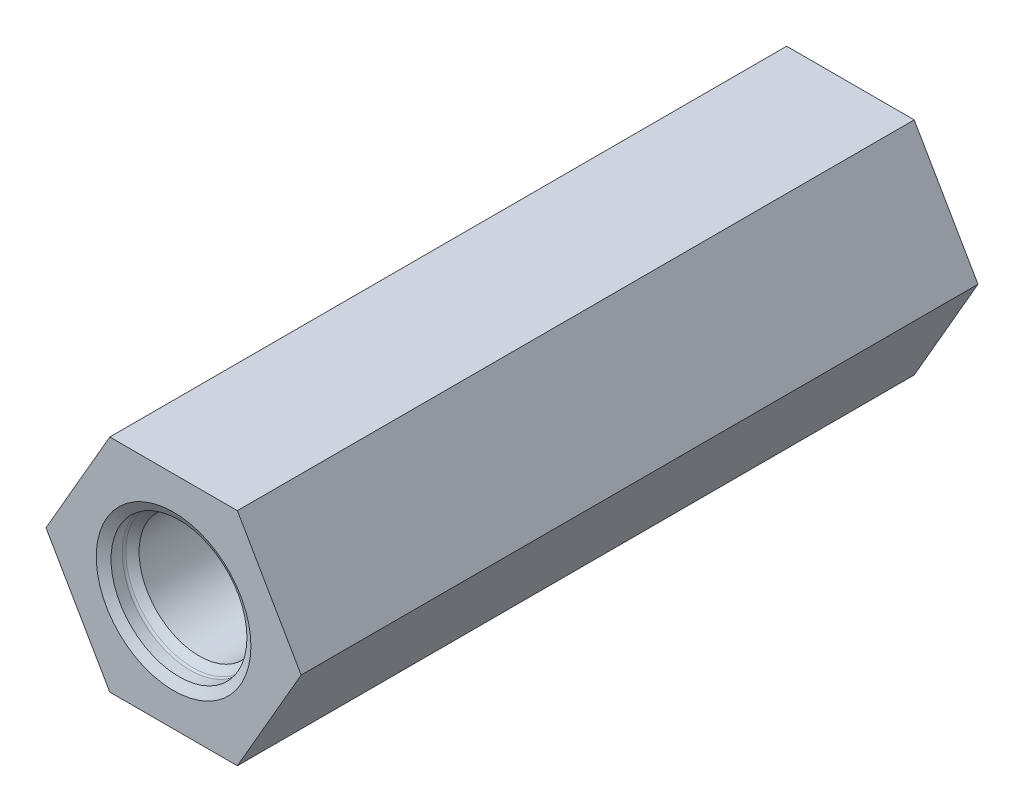
ISO-10303-21;
HEADER;
FILE_DESCRIPTION(('STEP AP214'),'2;1');
FILE_NAME('part.step','',(''),(''),'','','');
FILE_SCHEMA(('AUTOMOTIVE_DESIGN { 1 0 10303 214 1 1 1 1 }'));
ENDSEC;
DATA;
#1=APPLICATION_CONTEXT('core data for automotive mechanical design processes');
#2=APPLICATION_PROTOCOL_DEFINITION('international standard','automotive_design',2000,#1);
#3=PRODUCT_CONTEXT('',#1,'mechanical');
#4=PRODUCT('Part','Part','',(#3));
#5=PRODUCT_RELATED_PRODUCT_CATEGORY('part','',(#4));
#6=PRODUCT_DEFINITION_FORMATION('','',#4);
#7=PRODUCT_DEFINITION_CONTEXT('part definition',#1,'design');
#8=PRODUCT_DEFINITION('design','',#6,#7);
#9=PRODUCT_DEFINITION_SHAPE('','',#8);
#10=(LENGTH_UNIT() NAMED_UNIT(*) SI_UNIT(.MILLI.,.METRE.));
#11=(NAMED_UNIT(*) PLANE_ANGLE_UNIT() SI_UNIT($,.RADIAN.));
#12=(NAMED_UNIT(*) SI_UNIT($,.STERADIAN.) SOLID_ANGLE_UNIT());
#13=UNCERTAINTY_MEASURE_WITH_UNIT(LENGTH_MEASURE(1.E-05),#10,'distance_accuracy_value','');
#14=(GEOMETRIC_REPRESENTATION_CONTEXT(3) GLOBAL_UNCERTAINTY_ASSIGNED_CONTEXT((#13)) GLOBAL_UNIT_ASSIGNED_CONTEXT((#10,
#11,#12)) REPRESENTATION_CONTEXT('',''));
#15=CARTESIAN_POINT('',(0.,0.,0.));
#16=DIRECTION('',(0.,0.,1.));
#17=DIRECTION('',(1.,0.,0.));
#18=AXIS2_PLACEMENT_3D('',#15,#16,#17);
#19=CARTESIAN_POINT('',(0.,0.,26.162));
#20=DIRECTION('',(0.,0.,-1.));
#21=DIRECTION('',(-1.,0.,0.));
#22=AXIS2_PLACEMENT_3D('',#19,#20,#21);
#23=CYLINDRICAL_SURFACE('',#22,6.3754);
#24=CARTESIAN_POINT('',(-2.03314907367152,-6.04251851500917,21.59));
#25=CARTESIAN_POINT('',(-2.0331370575578,-6.0425188183239,21.4867851013207));
#26=CARTESIAN_POINT('',(-2.03794865062864,-6.04090894637527,21.3836129702349));
#27=CARTESIAN_POINT('',(-2.05697745294591,-6.03445775060883,21.1782088212646));
#28=CARTESIAN_POINT('',(-2.07119645824721,-6.02961580972568,21.0759769866802));
#29=CARTESIAN_POINT('',(-2.10855293049997,-6.01665314263859,20.8732486112649));
#30=CARTESIAN_POINT('',(-2.13170161069558,-6.00852829338303,20.7727544188834));
#31=CARTESIAN_POINT('',(-2.18613937401214,-5.98893601687927,20.5743097709583));
#32=CARTESIAN_POINT('',(-2.21743259463609,-5.97746689034937,20.4763606362242));
#33=CARTESIAN_POINT('',(-2.32148989194522,-5.93817084015464,20.189128083578));
#34=CARTESIAN_POINT('',(-2.40486464995926,-5.90532106123124,20.0042895234161));
#35=CARTESIAN_POINT('',(-2.59283520788646,-5.82523292218468,19.6494002160034));
#36=CARTESIAN_POINT('',(-2.69743561543405,-5.77799143681188,19.4793526910399));
#37=CARTESIAN_POINT('',(-2.93890865683772,-5.65944214459436,19.1302732554517));
#38=CARTESIAN_POINT('',(-3.07827027653292,-5.58556050798338,18.9538364641958));
#39=CARTESIAN_POINT('',(-3.36962164233222,-5.41478450585516,18.6235800032059));
#40=CARTESIAN_POINT('',(-3.52162332633979,-5.31786822104639,18.4697821032894));
#41=CARTESIAN_POINT('',(-3.76485355299338,-5.14619852726385,18.2482806792272));
#42=CARTESIAN_POINT('',(-3.85420158895494,-5.07975423103156,18.1719330691308));
#43=CARTESIAN_POINT('',(-4.03353883974174,-4.93855159314286,18.028235444797));
#44=CARTESIAN_POINT('',(-4.12352776448058,-4.86379681384201,17.9608816023536));
#45=CARTESIAN_POINT('',(-4.3028415655266,-4.70590540492443,17.835947471298));
#46=CARTESIAN_POINT('',(-4.39216678305047,-4.62277345609321,17.7783617724278));
#47=CARTESIAN_POINT('',(-4.56887189886833,-4.44820699733545,17.6737488215455));
#48=CARTESIAN_POINT('',(-4.65625220188703,-4.35677423525493,17.6267193539879));
#49=CARTESIAN_POINT('',(-4.81820248358557,-4.17656095263081,17.548614816817));
#50=CARTESIAN_POINT('',(-4.89311964888449,-4.08860760093343,17.516349819812));
#51=CARTESIAN_POINT('',(-5.0393623398526,-3.90693504399104,17.4613363485931));
#52=CARTESIAN_POINT('',(-5.11068855214855,-3.81321694869641,17.4385860489466));
#53=CARTESIAN_POINT('',(-5.24876710650366,-3.62079805999627,17.4030237211067));
#54=CARTESIAN_POINT('',(-5.31552378819448,-3.52210215316743,17.3902021409127));
#55=CARTESIAN_POINT('',(-5.44370753711686,-3.32054659788616,17.374711352774));
#56=CARTESIAN_POINT('',(-5.50513533601186,-3.2176875238959,17.3720407489226));
#57=CARTESIAN_POINT('',(-5.61321463273305,-3.02454876051913,17.376532701524));
#58=CARTESIAN_POINT('',(-5.66070006487378,-2.9346984191047,17.3822794211601));
#59=CARTESIAN_POINT('',(-5.75105820724428,-2.75341847306455,17.4010552780294));
#60=CARTESIAN_POINT('',(-5.79392955899573,-2.66198841248278,17.4140865530259));
#61=CARTESIAN_POINT('',(-5.87483749803305,-2.47832052904433,17.4472518360044));
#62=CARTESIAN_POINT('',(-5.91287572200012,-2.38608299100102,17.4673834307809));
#63=CARTESIAN_POINT('',(-5.98407234835712,-2.20145744669158,17.5144870248974));
#64=CARTESIAN_POINT('',(-6.01722885122136,-2.10906939592271,17.5414616758794));
#65=CARTESIAN_POINT('',(-6.10916583181434,-1.83334478154829,17.6319889321352));
#66=CARTESIAN_POINT('',(-6.16074362427262,-1.65068821011808,17.7052848065934));
#67=CARTESIAN_POINT('',(-6.24578958879975,-1.29224133720656,17.8749845319125));
#68=CARTESIAN_POINT('',(-6.27925436169099,-1.11645233026496,17.9713927152472));
#69=CARTESIAN_POINT('',(-6.33376941273993,-0.75304804942321,18.1985925154279));
#70=CARTESIAN_POINT('',(-6.3526271581918,-0.566887250358405,18.3322304153752));
#71=CARTESIAN_POINT('',(-6.37434589974819,-0.212251733006239,18.6227844418999));
#72=CARTESIAN_POINT('',(-6.37718203403838,-0.043804899906035,18.779736359348));
#73=CARTESIAN_POINT('',(-6.37278610287283,0.203830751083498,19.0436022199468));
#74=CARTESIAN_POINT('',(-6.36930906167396,0.290610352535047,19.1435596339514));
#75=CARTESIAN_POINT('',(-6.35963371278686,0.455658023740201,19.3501435899834));
#76=CARTESIAN_POINT('',(-6.35343480603832,0.533924215027797,19.4567715957207));
#77=CARTESIAN_POINT('',(-6.33236532480172,0.753980370263467,19.7859793390797));
#78=CARTESIAN_POINT('',(-6.31500187550329,0.881532247205133,20.018409693044));
#79=CARTESIAN_POINT('',(-6.28754598946052,1.05740510154389,20.435811024595));
#80=CARTESIAN_POINT('',(-6.27678550948411,1.11793023193376,20.615629778819));
#81=CARTESIAN_POINT('',(-6.259973432144,1.20856406652653,20.9829146542108));
#82=CARTESIAN_POINT('',(-6.25391389795248,1.23872406336782,21.1703673208764));
#83=CARTESIAN_POINT('',(-6.24849630998751,1.26579983291013,21.5485720582015));
#84=CARTESIAN_POINT('',(-6.24916535842303,1.26258115728527,21.7393343802194));
#85=CARTESIAN_POINT('',(-6.25704039544116,1.22292044357705,22.1172967237932));
#86=CARTESIAN_POINT('',(-6.26425175359991,1.18645111502268,22.3044936902217));
#87=CARTESIAN_POINT('',(-6.28240290565684,1.08607371304753,22.6620233800491));
#88=CARTESIAN_POINT('',(-6.29316359907238,1.02345119161935,22.8327358026317));
#89=CARTESIAN_POINT('',(-6.31549011687413,0.875167280235777,23.1636826187533));
#90=CARTESIAN_POINT('',(-6.32705620780751,0.789498235892869,23.3239135090659));
#91=CARTESIAN_POINT('',(-6.35000793070989,0.579916787941198,23.6633823650095));
#92=CARTESIAN_POINT('',(-6.36089814014887,0.451785259710807,23.8400435580918));
#93=CARTESIAN_POINT('',(-6.37458212961861,0.173069163443851,24.1751910748327));
#94=CARTESIAN_POINT('',(-6.37736598407114,0.022457306940102,24.3336548895382));
#95=CARTESIAN_POINT('',(-6.36975078628892,-0.330728900445925,24.662146850907));
#96=CARTESIAN_POINT('',(-6.35645144879133,-0.537566165823935,24.8275803003689));
#97=CARTESIAN_POINT('',(-6.30478693970404,-0.971056791560973,25.1251887580276));
#98=CARTESIAN_POINT('',(-6.26644527134361,-1.19769139872381,25.2573947905287));
#99=CARTESIAN_POINT('',(-6.16971904853107,-1.61778386353928,25.4610169395708));
#100=CARTESIAN_POINT('',(-6.11667837289289,-1.80912871774754,25.539253982408));
#101=CARTESIAN_POINT('',(-6.02123006178371,-2.09781867839265,25.6352022289412));
#102=CARTESIAN_POINT('',(-5.98675993021702,-2.1943415491342,25.663619656697));
#103=CARTESIAN_POINT('',(-5.91248820288261,-2.38722963598347,25.7129844526176));
#104=CARTESIAN_POINT('',(-5.87268875152761,-2.48359489980399,25.7339348130307));
#105=CARTESIAN_POINT('',(-5.78763764821154,-2.67583231360076,25.7681537970706));
#106=CARTESIAN_POINT('',(-5.74236138164202,-2.77170005340558,25.7813860578082));
#107=CARTESIAN_POINT('',(-5.64675103781995,-2.96162524180933,25.7998140453012));
#108=CARTESIAN_POINT('',(-5.59641904096843,-3.05568341620221,25.8050130633741));
#109=CARTESIAN_POINT('',(-5.49103531806099,-3.24124095026326,25.8073020473605));
#110=CARTESIAN_POINT('',(-5.435982760772,-3.33273985549795,25.8043905822631));
#111=CARTESIAN_POINT('',(-5.32165226771686,-3.51241823133756,25.7905025060141));
#112=CARTESIAN_POINT('',(-5.262374504544,-3.60059783730626,25.7795262241277));
#113=CARTESIAN_POINT('',(-5.14437183096311,-3.76707372525184,25.7507030015666));
#114=CARTESIAN_POINT('',(-5.08588876941042,-3.84563279436523,25.7333799428956));
#115=CARTESIAN_POINT('',(-4.96627405285197,-3.99891456332899,25.6921081661993));
#116=CARTESIAN_POINT('',(-4.90514150570314,-4.07363595214489,25.6681572015546));
#117=CARTESIAN_POINT('',(-4.71862421114552,-4.29147327510678,25.5867712057312));
#118=CARTESIAN_POINT('',(-4.59002222542035,-4.42839872973822,25.5197788448186));
#119=CARTESIAN_POINT('',(-4.32083311828951,-4.69189159141658,25.3581551448359));
#120=CARTESIAN_POINT('',(-4.17999642101902,-4.81729631312714,25.2620718558443));
#121=CARTESIAN_POINT('',(-3.8987954642153,-5.0475920467497,25.0472667688591));
#122=CARTESIAN_POINT('',(-3.75843156351975,-5.15246991683649,24.9285305633034));
#123=CARTESIAN_POINT('',(-3.46130973188953,-5.35747393807893,24.6507622547977));
#124=CARTESIAN_POINT('',(-3.30543453989242,-5.45427333059767,24.4883307778605));
#125=CARTESIAN_POINT('',(-3.00808524491948,-5.62373951342624,24.139247448442));
#126=CARTESIAN_POINT('',(-2.86662082885426,-5.6963901442351,23.9525794934565));
#127=CARTESIAN_POINT('',(-2.61882458643902,-5.81416845905753,23.5750197456534));
#128=CARTESIAN_POINT('',(-2.51046701562281,-5.86119933327316,23.3860587122575));
#129=CARTESIAN_POINT('',(-2.32144248791677,-5.93861214475131,22.9916893264351));
#130=CARTESIAN_POINT('',(-2.24071754412174,-5.96902902733269,22.7863165458026));
#131=CARTESIAN_POINT('',(-2.13142064531282,-6.00876605233198,22.4155492595577));
#132=CARTESIAN_POINT('',(-2.09488152560429,-6.02144649901733,22.2528618523694));
#133=CARTESIAN_POINT('',(-2.04576253477223,-6.03831997228084,21.9234108176512));
#134=CARTESIAN_POINT('',(-2.03316847475929,-6.04251802528048,21.7566496634407));
#135=CARTESIAN_POINT('',(-2.03314907367152,-6.04251851500917,21.59));
#136=B_SPLINE_CURVE_WITH_KNOTS('',3,(#24,#25,#26,#27,#28,#29,#30,#31,#32,#33,#34,#35,#36,#37,
#38,#39,#40,#41,#42,#43,#44,#45,#46,#47,#48,#49,#50,#51,#52,#53,#54,#55,#56,#57,#58,#59,#60,#61,
#62,#63,#64,#65,#66,#67,#68,#69,#70,#71,#72,#73,#74,#75,#76,#77,#78,#79,#80,#81,#82,#83,#84,#85,
#86,#87,#88,#89,#90,#91,#92,#93,#94,#95,#96,#97,#98,#99,#100,#101,#102,#103,#104,#105,#106,#107,
#108,#109,#110,#111,#112,#113,#114,#115,#116,#117,#118,#119,#120,#121,#122,#123,#124,#125,#126,
#127,#128,#129,#130,#131,#132,#133,#134,#135),.UNSPECIFIED.,.T.,.F.,(4,2,2,2,2,2,2,2,2,2,2,2,2,
2,2,2,2,2,2,2,2,2,2,2,2,2,2,2,2,2,2,2,2,2,2,2,2,2,2,2,2,2,2,2,2,2,2,2,2,2,2,2,2,2,2,4),(0.,
0.309448303531951,0.618955703717077,0.92885303293183,1.23890810123504,1.85245353228132,
2.46613229366875,3.17354819729196,3.88163997747334,4.28618785897242,4.69056299159343,
5.09471341740329,5.49877894049994,5.85810728746754,6.21736666419853,6.57627998180749,
6.93514394183593,7.24014050676989,7.545226624602,7.85020915172852,8.15531003869406,
8.7630219767322,9.37084792145026,10.0580677852884,10.7463537622063,11.1431678007208,
11.5400692185663,12.3317099777673,12.8996168930445,13.4665628849987,14.0357934031087,
14.6054915381071,15.1499809336188,15.6946513928562,16.3478799338502,17.0019079649136,
17.7936968328853,18.5847436411214,19.2220435897256,19.5407859263628,19.8594003906569,
20.1795040898534,20.4994766038505,20.8195055772634,21.1395214854582,21.4375498908815,
21.7356794411181,22.3314361569511,22.9640020513948,23.5969716156851,24.3292435401714,
25.0620044933801,25.7280728278758,26.3927347278066,26.8926629549138,27.3922948520115),.UNSPECIFIED.);
#137=CARTESIAN_POINT('',(-2.03314907367152,-6.04251851500917,21.59));
#138=VERTEX_POINT('',#137);
#139=EDGE_CURVE('E143',#138,#138,#136,.T.);
#140=ORIENTED_EDGE('',*,*,#139,.F.);
#141=EDGE_LOOP('',(#140));
#142=FACE_BOUND('',#141,.T.);
#143=CARTESIAN_POINT('',(0.,0.,3.30922048968553));
#144=DIRECTION('',(0.,0.,1.));
#145=DIRECTION('',(1.,0.,0.));
#146=AXIS2_PLACEMENT_3D('',#143,#144,#145);
#147=CIRCLE('',#146,6.3754);
#148=CARTESIAN_POINT('',(6.3754,0.,3.30922048968553));
#149=VERTEX_POINT('',#148);
#150=EDGE_CURVE('E226',#149,#149,#147,.T.);
#151=ORIENTED_EDGE('',*,*,#150,.F.);
#152=EDGE_LOOP('',(#151));
#153=FACE_BOUND('',#152,.T.);
#154=CARTESIAN_POINT('',(0.,0.,26.162));
#155=DIRECTION('',(0.,0.,-1.));
#156=DIRECTION('',(-1.,0.,0.));
#157=AXIS2_PLACEMENT_3D('',#154,#155,#156);
#158=CIRCLE('',#157,6.3754);
#159=CARTESIAN_POINT('',(-6.3754,0.,26.162));
#160=VERTEX_POINT('',#159);
#161=EDGE_CURVE('E151',#160,#160,#158,.T.);
#162=ORIENTED_EDGE('',*,*,#161,.F.);
#163=EDGE_LOOP('',(#162));
#164=FACE_BOUND('',#163,.T.);
#165=ADVANCED_FACE('F39',(#142,#153,#164),#23,.F.);
#166=CARTESIAN_POINT('',(0.,0.,33.759775));
#167=DIRECTION('',(0.,0.,1.));
#168=DIRECTION('',(1.,0.,0.));
#169=AXIS2_PLACEMENT_3D('',#166,#167,#168);
#170=CYLINDRICAL_SURFACE('',#169,7.14375);
#171=CARTESIAN_POINT('',(0.,0.,33.759775));
#172=DIRECTION('',(0.,0.,1.));
#173=DIRECTION('',(1.,0.,0.));
#174=AXIS2_PLACEMENT_3D('',#171,#172,#173);
#175=CIRCLE('',#174,7.14375);
#176=CARTESIAN_POINT('',(7.14375,0.,33.759775));
#177=VERTEX_POINT('',#176);
#178=EDGE_CURVE('E250',#177,#177,#175,.T.);
#179=ORIENTED_EDGE('',*,*,#178,.F.);
#180=EDGE_LOOP('',(#179));
#181=FACE_BOUND('',#180,.T.);
#182=CARTESIAN_POINT('',(0.,0.,76.922071969697));
#183=DIRECTION('',(0.,0.,1.));
#184=DIRECTION('',(1.,0.,0.));
#185=AXIS2_PLACEMENT_3D('',#182,#183,#184);
#186=CIRCLE('',#185,7.14375);
#187=CARTESIAN_POINT('',(7.14375,0.,76.922071969697));
#188=VERTEX_POINT('',#187);
#189=EDGE_CURVE('E43',#188,#188,#186,.F.);
#190=ORIENTED_EDGE('',*,*,#189,.F.);
#191=EDGE_LOOP('',(#190));
#192=FACE_BOUND('',#191,.T.);
#193=ADVANCED_FACE('F158',(#181,#192),#170,.F.);
#194=CARTESIAN_POINT('',(0.,0.,0.));
#195=DIRECTION('',(0.,0.,1.));
#196=DIRECTION('',(1.,0.,0.));
#197=AXIS2_PLACEMENT_3D('',#194,#195,#196);
#198=CYLINDRICAL_SURFACE('',#197,5.35813);
#199=CARTESIAN_POINT('',(0.,0.,26.162));
#200=DIRECTION('',(0.,0.,-1.));
#201=DIRECTION('',(-1.,0.,0.));
#202=AXIS2_PLACEMENT_3D('',#199,#200,#201);
#203=CIRCLE('',#202,5.35813);
#204=CARTESIAN_POINT('',(-5.35813,0.,26.162));
#205=VERTEX_POINT('',#204);
#206=EDGE_CURVE('E150',#205,#205,#203,.F.);
#207=ORIENTED_EDGE('',*,*,#206,.F.);
#208=EDGE_LOOP('',(#207));
#209=FACE_BOUND('',#208,.T.);
#210=CARTESIAN_POINT('',(0.,0.,33.759775));
#211=DIRECTION('',(0.,0.,1.));
#212=DIRECTION('',(1.,0.,0.));
#213=AXIS2_PLACEMENT_3D('',#210,#211,#212);
#214=CIRCLE('',#213,5.35813);
#215=CARTESIAN_POINT('',(5.35813,0.,33.759775));
#216=VERTEX_POINT('',#215);
#217=EDGE_CURVE('E253',#216,#216,#214,.F.);
#218=ORIENTED_EDGE('',*,*,#217,.F.);
#219=EDGE_LOOP('',(#218));
#220=FACE_BOUND('',#219,.T.);
#221=ADVANCED_FACE('F167',(#209,#220),#198,.F.);
#222=CARTESIAN_POINT('',(-9.16543552338532,15.875,97.259775));
#223=DIRECTION('',(0.866025403784439,-0.499999999999999,0.));
#224=DIRECTION('',(0.499999999999999,0.866025403784439,0.));
#225=AXIS2_PLACEMENT_3D('',#222,#223,#224);
#226=PLANE('',#225);
#227=DIRECTION('',(-0.499999999999999,-0.866025403784439,0.));
#228=VECTOR('',#227,1.);
#229=CARTESIAN_POINT('',(-9.16543552338532,15.875,0.));
#230=LINE('',#229,#228);
#231=CARTESIAN_POINT('',(-9.16543552338532,15.875,0.));
#232=VERTEX_POINT('',#231);
#233=CARTESIAN_POINT('',(-18.3308710467706,0.,0.));
#234=VERTEX_POINT('',#233);
#235=EDGE_CURVE('E126',#232,#234,#230,.T.);
#236=ORIENTED_EDGE('',*,*,#235,.T.);
#237=DIRECTION('',(0.,0.,-1.));
#238=VECTOR('',#237,1.);
#239=CARTESIAN_POINT('',(-18.3308710467706,0.,97.259775));
#240=LINE('',#239,#238);
#241=CARTESIAN_POINT('',(-18.3308710467706,0.,97.259775));
#242=VERTEX_POINT('',#241);
#243=EDGE_CURVE('E11',#242,#234,#240,.T.);
#244=ORIENTED_EDGE('',*,*,#243,.F.);
#245=DIRECTION('',(-0.499999999999999,-0.866025403784439,0.));
#246=VECTOR('',#245,1.);
#247=CARTESIAN_POINT('',(-9.16543552338532,15.875,97.259775));
#248=LINE('',#247,#246);
#249=CARTESIAN_POINT('',(-9.16543552338532,15.875,97.259775));
#250=VERTEX_POINT('',#249);
#251=EDGE_CURVE('E137',#250,#242,#248,.T.);
#252=ORIENTED_EDGE('',*,*,#251,.F.);
#253=DIRECTION('',(0.,0.,-1.));
#254=VECTOR('',#253,1.);
#255=CARTESIAN_POINT('',(-9.16543552338532,15.875,97.259775));
#256=LINE('',#255,#254);
#257=EDGE_CURVE('E122',#250,#232,#256,.T.);
#258=ORIENTED_EDGE('',*,*,#257,.T.);
#259=EDGE_LOOP('',(#236,#244,#252,#258));
#260=FACE_BOUND('',#259,.T.);
#261=ADVANCED_FACE('F41',(#260),#226,.F.);
#262=CARTESIAN_POINT('',(-18.3308710467706,0.,97.259775));
#263=DIRECTION('',(0.866025403784439,0.5,0.));
#264=DIRECTION('',(-0.5,0.866025403784439,0.));
#265=AXIS2_PLACEMENT_3D('',#262,#263,#264);
#266=PLANE('',#265);
#267=CARTESIAN_POINT('',(-13.748153285078,-7.93750000000001,21.59));
#268=DIRECTION('',(-0.866025403784439,-0.5,0.));
#269=DIRECTION('',(0.5,-0.866025403784439,0.));
#270=AXIS2_PLACEMENT_3D('',#267,#268,#269);
#271=CIRCLE('',#270,4.2164);
#272=CARTESIAN_POINT('',(-11.639953285078,-11.5890095125167,21.59));
#273=VERTEX_POINT('',#272);
#274=EDGE_CURVE('E130',#273,#273,#271,.T.);
#275=ORIENTED_EDGE('',*,*,#274,.F.);
#276=EDGE_LOOP('',(#275));
#277=FACE_BOUND('',#276,.T.);
#278=DIRECTION('',(0.5,-0.866025403784439,0.));
#279=VECTOR('',#278,1.);
#280=CARTESIAN_POINT('',(-18.3308710467706,0.,0.));
#281=LINE('',#280,#279);
#282=CARTESIAN_POINT('',(-9.16543552338532,-15.875,0.));
#283=VERTEX_POINT('',#282);
#284=EDGE_CURVE('E129',#234,#283,#281,.T.);
#285=ORIENTED_EDGE('',*,*,#284,.T.);
#286=DIRECTION('',(0.,0.,-1.));
#287=VECTOR('',#286,1.);
#288=CARTESIAN_POINT('',(-9.16543552338532,-15.875,97.259775));
#289=LINE('',#288,#287);
#290=CARTESIAN_POINT('',(-9.16543552338532,-15.875,97.259775));
#291=VERTEX_POINT('',#290);
#292=EDGE_CURVE('E49',#291,#283,#289,.T.);
#293=ORIENTED_EDGE('',*,*,#292,.F.);
#294=DIRECTION('',(0.5,-0.866025403784439,0.));
#295=VECTOR('',#294,1.);
#296=CARTESIAN_POINT('',(-18.3308710467706,0.,97.259775));
#297=LINE('',#296,#295);
#298=EDGE_CURVE('E95',#242,#291,#297,.T.);
#299=ORIENTED_EDGE('',*,*,#298,.F.);
#300=ORIENTED_EDGE('',*,*,#243,.T.);
#301=EDGE_LOOP('',(#285,#293,#299,#300));
#302=FACE_BOUND('',#301,.T.);
#303=ADVANCED_FACE('F261',(#277,#302),#266,.F.);
#304=CARTESIAN_POINT('',(-9.16543552338532,-15.875,97.259775));
#305=DIRECTION('',(0.,1.,0.));
#306=DIRECTION('',(-1.,0.,0.));
#307=AXIS2_PLACEMENT_3D('',#304,#305,#306);
#308=PLANE('',#307);
#309=DIRECTION('',(1.,0.,0.));
#310=VECTOR('',#309,1.);
#311=CARTESIAN_POINT('',(-9.16543552338532,-15.875,0.));
#312=LINE('',#311,#310);
#313=CARTESIAN_POINT('',(9.1654355233853,-15.875,0.));
#314=VERTEX_POINT('',#313);
#315=EDGE_CURVE('E132',#283,#314,#312,.T.);
#316=ORIENTED_EDGE('',*,*,#315,.T.);
#317=DIRECTION('',(0.,0.,-1.));
#318=VECTOR('',#317,1.);
#319=CARTESIAN_POINT('',(9.1654355233853,-15.875,97.259775));
#320=LINE('',#319,#318);
#321=CARTESIAN_POINT('',(9.1654355233853,-15.875,97.259775));
#322=VERTEX_POINT('',#321);
#323=EDGE_CURVE('E117',#322,#314,#320,.T.);
#324=ORIENTED_EDGE('',*,*,#323,.F.);
#325=DIRECTION('',(1.,0.,0.));
#326=VECTOR('',#325,1.);
#327=CARTESIAN_POINT('',(-9.16543552338532,-15.875,97.259775));
#328=LINE('',#327,#326);
#329=EDGE_CURVE('E108',#291,#322,#328,.T.);
#330=ORIENTED_EDGE('',*,*,#329,.F.);
#331=ORIENTED_EDGE('',*,*,#292,.T.);
#332=EDGE_LOOP('',(#316,#324,#330,#331));
#333=FACE_BOUND('',#332,.T.);
#334=ADVANCED_FACE('F264',(#333),#308,.F.);
#335=CARTESIAN_POINT('',(9.1654355233853,-15.875,97.259775));
#336=DIRECTION('',(-0.866025403784439,0.5,0.));
#337=DIRECTION('',(-0.5,-0.866025403784439,0.));
#338=AXIS2_PLACEMENT_3D('',#335,#336,#337);
#339=PLANE('',#338);
#340=DIRECTION('',(0.5,0.866025403784439,0.));
#341=VECTOR('',#340,1.);
#342=CARTESIAN_POINT('',(9.1654355233853,-15.875,0.));
#343=LINE('',#342,#341);
#344=CARTESIAN_POINT('',(18.3308710467706,0.,0.));
#345=VERTEX_POINT('',#344);
#346=EDGE_CURVE('E116',#314,#345,#343,.T.);
#347=ORIENTED_EDGE('',*,*,#346,.T.);
#348=DIRECTION('',(0.,0.,-1.));
#349=VECTOR('',#348,1.);
#350=CARTESIAN_POINT('',(18.3308710467706,0.,97.259775));
#351=LINE('',#350,#349);
#352=CARTESIAN_POINT('',(18.3308710467706,0.,97.259775));
#353=VERTEX_POINT('',#352);
#354=EDGE_CURVE('E113',#353,#345,#351,.T.);
#355=ORIENTED_EDGE('',*,*,#354,.F.);
#356=DIRECTION('',(0.5,0.866025403784439,0.));
#357=VECTOR('',#356,1.);
#358=CARTESIAN_POINT('',(9.1654355233853,-15.875,97.259775));
#359=LINE('',#358,#357);
#360=EDGE_CURVE('E102',#322,#353,#359,.T.);
#361=ORIENTED_EDGE('',*,*,#360,.F.);
#362=ORIENTED_EDGE('',*,*,#323,.T.);
#363=EDGE_LOOP('',(#347,#355,#361,#362));
#364=FACE_BOUND('',#363,.T.);
#365=ADVANCED_FACE('F114',(#364),#339,.F.);
#366=CARTESIAN_POINT('',(18.3308710467706,0.,97.259775));
#367=DIRECTION('',(-0.866025403784439,-0.5,0.));
#368=DIRECTION('',(0.5,-0.866025403784439,0.));
#369=AXIS2_PLACEMENT_3D('',#366,#367,#368);
#370=PLANE('',#369);
#371=DIRECTION('',(-0.5,0.866025403784439,0.));
#372=VECTOR('',#371,1.);
#373=CARTESIAN_POINT('',(18.3308710467706,0.,0.));
#374=LINE('',#373,#372);
#375=CARTESIAN_POINT('',(9.16543552338531,15.875,0.));
#376=VERTEX_POINT('',#375);
#377=EDGE_CURVE('E81',#345,#376,#374,.T.);
#378=ORIENTED_EDGE('',*,*,#377,.T.);
#379=DIRECTION('',(0.,0.,-1.));
#380=VECTOR('',#379,1.);
#381=CARTESIAN_POINT('',(9.16543552338531,15.875,97.259775));
#382=LINE('',#381,#380);
#383=CARTESIAN_POINT('',(9.16543552338531,15.875,97.259775));
#384=VERTEX_POINT('',#383);
#385=EDGE_CURVE('E118',#384,#376,#382,.T.);
#386=ORIENTED_EDGE('',*,*,#385,.F.);
#387=DIRECTION('',(-0.5,0.866025403784439,0.));
#388=VECTOR('',#387,1.);
#389=CARTESIAN_POINT('',(18.3308710467706,0.,97.259775));
#390=LINE('',#389,#388);
#391=EDGE_CURVE('E106',#353,#384,#390,.T.);
#392=ORIENTED_EDGE('',*,*,#391,.F.);
#393=ORIENTED_EDGE('',*,*,#354,.T.);
#394=EDGE_LOOP('',(#378,#386,#392,#393));
#395=FACE_BOUND('',#394,.T.);
#396=ADVANCED_FACE('F120',(#395),#370,.F.);
#397=CARTESIAN_POINT('',(9.16543552338531,15.875,97.259775));
#398=DIRECTION('',(0.,-1.,0.));
#399=DIRECTION('',(0.,0.,-1.));
#400=AXIS2_PLACEMENT_3D('',#397,#398,#399);
#401=PLANE('',#400);
#402=DIRECTION('',(-1.,0.,0.));
#403=VECTOR('',#402,1.);
#404=CARTESIAN_POINT('',(9.16543552338531,15.875,0.));
#405=LINE('',#404,#403);
#406=EDGE_CURVE('E87',#376,#232,#405,.T.);
#407=ORIENTED_EDGE('',*,*,#406,.T.);
#408=ORIENTED_EDGE('',*,*,#257,.F.);
#409=DIRECTION('',(-1.,0.,0.));
#410=VECTOR('',#409,1.);
#411=CARTESIAN_POINT('',(9.16543552338531,15.875,97.259775));
#412=LINE('',#411,#410);
#413=EDGE_CURVE('E58',#384,#250,#412,.T.);
#414=ORIENTED_EDGE('',*,*,#413,.F.);
#415=ORIENTED_EDGE('',*,*,#385,.T.);
#416=EDGE_LOOP('',(#407,#408,#414,#415));
#417=FACE_BOUND('',#416,.T.);
#418=ADVANCED_FACE('F269',(#417),#401,.F.);
#419=CARTESIAN_POINT('',(-27.4963065701559,-15.875,97.259775));
#420=DIRECTION('',(0.,0.,1.));
#421=DIRECTION('',(1.,0.,0.));
#422=AXIS2_PLACEMENT_3D('',#419,#420,#421);
#423=PLANE('',#422);
#424=CARTESIAN_POINT('',(0.,0.,97.259775));
#425=DIRECTION('',(0.,0.,1.));
#426=DIRECTION('',(1.,0.,0.));
#427=AXIS2_PLACEMENT_3D('',#424,#425,#426);
#428=CIRCLE('',#427,11.1125);
#429=CARTESIAN_POINT('',(11.1125,0.,97.259775));
#430=VERTEX_POINT('',#429);
#431=EDGE_CURVE('E232',#430,#430,#428,.T.);
#432=ORIENTED_EDGE('',*,*,#431,.F.);
#433=EDGE_LOOP('',(#432));
#434=FACE_BOUND('',#433,.T.);
#435=ORIENTED_EDGE('',*,*,#251,.T.);
#436=ORIENTED_EDGE('',*,*,#298,.T.);
#437=ORIENTED_EDGE('',*,*,#329,.T.);
#438=ORIENTED_EDGE('',*,*,#360,.T.);
#439=ORIENTED_EDGE('',*,*,#391,.T.);
#440=ORIENTED_EDGE('',*,*,#413,.T.);
#441=EDGE_LOOP('',(#435,#436,#437,#438,#439,#440));
#442=FACE_BOUND('',#441,.T.);
#443=ADVANCED_FACE('F104',(#434,#442),#423,.T.);
#444=CARTESIAN_POINT('',(-27.4963065701559,-15.875,0.));
#445=DIRECTION('',(0.,0.,1.));
#446=DIRECTION('',(1.,0.,0.));
#447=AXIS2_PLACEMENT_3D('',#444,#445,#446);
#448=PLANE('',#447);
#449=CARTESIAN_POINT('',(0.,0.,0.));
#450=DIRECTION('',(0.,0.,1.));
#451=DIRECTION('',(1.,0.,0.));
#452=AXIS2_PLACEMENT_3D('',#449,#450,#451);
#453=CIRCLE('',#452,8.7376);
#454=CARTESIAN_POINT('',(8.7376,0.,0.));
#455=VERTEX_POINT('',#454);
#456=EDGE_CURVE('E229',#455,#455,#453,.T.);
#457=ORIENTED_EDGE('',*,*,#456,.T.);
#458=EDGE_LOOP('',(#457));
#459=FACE_BOUND('',#458,.T.);
#460=ORIENTED_EDGE('',*,*,#235,.F.);
#461=ORIENTED_EDGE('',*,*,#406,.F.);
#462=ORIENTED_EDGE('',*,*,#377,.F.);
#463=ORIENTED_EDGE('',*,*,#346,.F.);
#464=ORIENTED_EDGE('',*,*,#315,.F.);
#465=ORIENTED_EDGE('',*,*,#284,.F.);
#466=EDGE_LOOP('',(#460,#461,#462,#463,#464,#465));
#467=FACE_BOUND('',#466,.T.);
#468=ADVANCED_FACE('F267',(#459,#467),#448,.F.);
#469=CARTESIAN_POINT('',(20.6234129403188,11.9069330127019,21.59));
#470=DIRECTION('',(-0.866025403784439,-0.5,0.));
#471=DIRECTION('',(0.5,-0.866025403784439,0.));
#472=AXIS2_PLACEMENT_3D('',#469,#470,#471);
#473=CYLINDRICAL_SURFACE('',#472,4.2164);
#474=ORIENTED_EDGE('',*,*,#139,.T.);
#475=EDGE_LOOP('',(#474));
#476=FACE_BOUND('',#475,.T.);
#477=ORIENTED_EDGE('',*,*,#274,.T.);
#478=EDGE_LOOP('',(#477));
#479=FACE_BOUND('',#478,.T.);
#480=ADVANCED_FACE('F152',(#476,#479),#473,.F.);
#481=CARTESIAN_POINT('',(0.,0.,26.162));
#482=DIRECTION('',(0.,0.,-1.));
#483=DIRECTION('',(-1.,0.,0.));
#484=AXIS2_PLACEMENT_3D('',#481,#482,#483);
#485=PLANE('',#484);
#486=ORIENTED_EDGE('',*,*,#161,.T.);
#487=EDGE_LOOP('',(#486));
#488=FACE_BOUND('',#487,.T.);
#489=ORIENTED_EDGE('',*,*,#206,.T.);
#490=EDGE_LOOP('',(#489));
#491=FACE_BOUND('',#490,.T.);
#492=ADVANCED_FACE('F160',(#488,#491),#485,.T.);
#493=CARTESIAN_POINT('',(0.,0.,33.759775));
#494=DIRECTION('',(0.,0.,1.));
#495=DIRECTION('',(1.,0.,0.));
#496=AXIS2_PLACEMENT_3D('',#493,#494,#495);
#497=PLANE('',#496);
#498=ORIENTED_EDGE('',*,*,#178,.T.);
#499=EDGE_LOOP('',(#498));
#500=FACE_BOUND('',#499,.T.);
#501=ORIENTED_EDGE('',*,*,#217,.T.);
#502=EDGE_LOOP('',(#501));
#503=FACE_BOUND('',#502,.T.);
#504=ADVANCED_FACE('F163',(#500,#503),#497,.T.);
#505=CARTESIAN_POINT('',(0.,0.,76.076175));
#506=DIRECTION('',(0.,0.,1.));
#507=DIRECTION('',(1.,0.,0.));
#508=AXIS2_PLACEMENT_3D('',#505,#506,#507);
#509=CONICAL_SURFACE('',#508,6.1468,0.867182544015444);
#510=CARTESIAN_POINT('',(0.,0.,78.209775));
#511=DIRECTION('',(0.,0.,1.));
#512=DIRECTION('',(1.,0.,0.));
#513=AXIS2_PLACEMENT_3D('',#510,#511,#512);
#514=CIRCLE('',#513,8.6614);
#515=CARTESIAN_POINT('',(8.6614,0.,78.209775));
#516=VERTEX_POINT('',#515);
#517=EDGE_CURVE('E247',#516,#516,#514,.T.);
#518=ORIENTED_EDGE('',*,*,#517,.T.);
#519=EDGE_LOOP('',(#518));
#520=FACE_BOUND('',#519,.T.);
#521=ORIENTED_EDGE('',*,*,#189,.T.);
#522=EDGE_LOOP('',(#521));
#523=FACE_BOUND('',#522,.T.);
#524=ADVANCED_FACE('F171',(#520,#523),#509,.F.);
#525=CARTESIAN_POINT('',(0.,0.,97.259775));
#526=DIRECTION('',(0.,0.,1.));
#527=DIRECTION('',(1.,0.,0.));
#528=AXIS2_PLACEMENT_3D('',#525,#526,#527);
#529=CYLINDRICAL_SURFACE('',#528,8.6614);
#530=CARTESIAN_POINT('',(0.,0.,93.5568545103145));
#531=DIRECTION('',(0.,0.,1.));
#532=DIRECTION('',(1.,0.,0.));
#533=AXIS2_PLACEMENT_3D('',#530,#531,#532);
#534=CIRCLE('',#533,8.6614);
#535=CARTESIAN_POINT('',(8.6614,0.,93.5568545103145));
#536=VERTEX_POINT('',#535);
#537=EDGE_CURVE('E244',#536,#536,#534,.T.);
#538=ORIENTED_EDGE('',*,*,#537,.T.);
#539=EDGE_LOOP('',(#538));
#540=FACE_BOUND('',#539,.T.);
#541=ORIENTED_EDGE('',*,*,#517,.F.);
#542=EDGE_LOOP('',(#541));
#543=FACE_BOUND('',#542,.T.);
#544=ADVANCED_FACE('F175',(#540,#543),#529,.F.);
#545=CARTESIAN_POINT('',(0.,0.,93.5568545103145));
#546=DIRECTION('',(0.,0.,1.));
#547=DIRECTION('',(1.,0.,0.));
#548=AXIS2_PLACEMENT_3D('',#545,#546,#547);
#549=CONICAL_SURFACE('',#548,8.6614,0.785398163397456);
#550=CARTESIAN_POINT('',(0.,0.,94.5129647551572));
#551=DIRECTION('',(0.,0.,1.));
#552=DIRECTION('',(1.,0.,0.));
#553=AXIS2_PLACEMENT_3D('',#550,#551,#552);
#554=CIRCLE('',#553,9.61751024484277);
#555=CARTESIAN_POINT('',(9.61751024484277,0.,94.5129647551572));
#556=VERTEX_POINT('',#555);
#557=EDGE_CURVE('E241',#556,#556,#554,.T.);
#558=ORIENTED_EDGE('',*,*,#557,.T.);
#559=EDGE_LOOP('',(#558));
#560=FACE_BOUND('',#559,.T.);
#561=ORIENTED_EDGE('',*,*,#537,.F.);
#562=EDGE_LOOP('',(#561));
#563=FACE_BOUND('',#562,.T.);
#564=ADVANCED_FACE('F179',(#560,#563),#549,.F.);
#565=CARTESIAN_POINT('',(0.,0.,94.872175));
#566=DIRECTION('',(0.,0.,1.));
#567=DIRECTION('',(1.,0.,0.));
#568=AXIS2_PLACEMENT_3D('',#565,#566,#567);
#569=TOROIDAL_SURFACE('',#568,9.2583,0.508000000000002);
#570=CARTESIAN_POINT('',(0.,0.,94.872175));
#571=DIRECTION('',(0.,0.,1.));
#572=DIRECTION('',(1.,0.,0.));
#573=AXIS2_PLACEMENT_3D('',#570,#571,#572);
#574=CIRCLE('',#573,9.7663);
#575=CARTESIAN_POINT('',(9.7663,0.,94.872175));
#576=VERTEX_POINT('',#575);
#577=EDGE_CURVE('E238',#576,#576,#574,.T.);
#578=ORIENTED_EDGE('',*,*,#577,.T.);
#579=EDGE_LOOP('',(#578));
#580=FACE_BOUND('',#579,.T.);
#581=ORIENTED_EDGE('',*,*,#557,.F.);
#582=EDGE_LOOP('',(#581));
#583=FACE_BOUND('',#582,.T.);
#584=ADVANCED_FACE('F183',(#580,#583),#569,.F.);
#585=CARTESIAN_POINT('',(0.,0.,97.259775));
#586=DIRECTION('',(0.,0.,1.));
#587=DIRECTION('',(1.,0.,0.));
#588=AXIS2_PLACEMENT_3D('',#585,#586,#587);
#589=CYLINDRICAL_SURFACE('',#588,9.7663);
#590=CARTESIAN_POINT('',(0.,0.,96.4825460676169));
#591=DIRECTION('',(0.,0.,1.));
#592=DIRECTION('',(1.,0.,0.));
#593=AXIS2_PLACEMENT_3D('',#590,#591,#592);
#594=CIRCLE('',#593,9.7663);
#595=CARTESIAN_POINT('',(9.7663,0.,96.4825460676169));
#596=VERTEX_POINT('',#595);
#597=EDGE_CURVE('E235',#596,#596,#594,.T.);
#598=ORIENTED_EDGE('',*,*,#597,.T.);
#599=EDGE_LOOP('',(#598));
#600=FACE_BOUND('',#599,.T.);
#601=ORIENTED_EDGE('',*,*,#577,.F.);
#602=EDGE_LOOP('',(#601));
#603=FACE_BOUND('',#602,.T.);
#604=ADVANCED_FACE('F187',(#600,#603),#589,.F.);
#605=CARTESIAN_POINT('',(0.,0.,96.4825460676169));
#606=DIRECTION('',(0.,0.,1.));
#607=DIRECTION('',(1.,0.,0.));
#608=AXIS2_PLACEMENT_3D('',#605,#606,#607);
#609=CONICAL_SURFACE('',#608,9.7663,1.0471975511966);
#610=ORIENTED_EDGE('',*,*,#431,.T.);
#611=EDGE_LOOP('',(#610));
#612=FACE_BOUND('',#611,.T.);
#613=ORIENTED_EDGE('',*,*,#597,.F.);
#614=EDGE_LOOP('',(#613));
#615=FACE_BOUND('',#614,.T.);
#616=ADVANCED_FACE('F191',(#612,#615),#609,.F.);
#617=CARTESIAN_POINT('',(0.,0.,0.));
#618=DIRECTION('',(0.,0.,-1.));
#619=DIRECTION('',(-1.,0.,0.));
#620=AXIS2_PLACEMENT_3D('',#617,#618,#619);
#621=CONICAL_SURFACE('',#620,8.7376,1.04719755119659);
#622=CARTESIAN_POINT('',(0.,0.,0.7918936292205));
#623=DIRECTION('',(0.,0.,1.));
#624=DIRECTION('',(1.,0.,0.));
#625=AXIS2_PLACEMENT_3D('',#622,#623,#624);
#626=CIRCLE('',#625,7.366);
#627=CARTESIAN_POINT('',(7.366,0.,0.7918936292205));
#628=VERTEX_POINT('',#627);
#629=EDGE_CURVE('E219',#628,#628,#626,.T.);
#630=ORIENTED_EDGE('',*,*,#629,.T.);
#631=EDGE_LOOP('',(#630));
#632=FACE_BOUND('',#631,.T.);
#633=ORIENTED_EDGE('',*,*,#456,.F.);
#634=EDGE_LOOP('',(#633));
#635=FACE_BOUND('',#634,.T.);
#636=ADVANCED_FACE('F195',(#632,#635),#621,.F.);
#637=CARTESIAN_POINT('',(0.,0.,2.46741024484277));
#638=DIRECTION('',(0.,0.,-1.));
#639=DIRECTION('',(-1.,0.,0.));
#640=AXIS2_PLACEMENT_3D('',#637,#638,#639);
#641=CONICAL_SURFACE('',#640,7.21721024484277,0.785398163397451);
#642=ORIENTED_EDGE('',*,*,#150,.T.);
#643=EDGE_LOOP('',(#642));
#644=FACE_BOUND('',#643,.T.);
#645=CARTESIAN_POINT('',(0.,0.,2.46741024484277));
#646=DIRECTION('',(0.,0.,1.));
#647=DIRECTION('',(1.,0.,0.));
#648=AXIS2_PLACEMENT_3D('',#645,#646,#647);
#649=CIRCLE('',#648,7.21721024484277);
#650=CARTESIAN_POINT('',(7.21721024484277,0.,2.46741024484277));
#651=VERTEX_POINT('',#650);
#652=EDGE_CURVE('E221',#651,#651,#649,.T.);
#653=ORIENTED_EDGE('',*,*,#652,.F.);
#654=EDGE_LOOP('',(#653));
#655=FACE_BOUND('',#654,.T.);
#656=ADVANCED_FACE('F199',(#644,#655),#641,.F.);
#657=CARTESIAN_POINT('',(0.,0.,2.1082));
#658=DIRECTION('',(0.,0.,1.));
#659=DIRECTION('',(1.,0.,0.));
#660=AXIS2_PLACEMENT_3D('',#657,#658,#659);
#661=TOROIDAL_SURFACE('',#660,6.858,0.508);
#662=ORIENTED_EDGE('',*,*,#652,.T.);
#663=EDGE_LOOP('',(#662));
#664=FACE_BOUND('',#663,.T.);
#665=CARTESIAN_POINT('',(0.,0.,2.1082));
#666=DIRECTION('',(0.,0.,1.));
#667=DIRECTION('',(1.,0.,0.));
#668=AXIS2_PLACEMENT_3D('',#665,#666,#667);
#669=CIRCLE('',#668,7.366);
#670=CARTESIAN_POINT('',(7.366,0.,2.1082));
#671=VERTEX_POINT('',#670);
#672=EDGE_CURVE('E216',#671,#671,#669,.T.);
#673=ORIENTED_EDGE('',*,*,#672,.F.);
#674=EDGE_LOOP('',(#673));
#675=FACE_BOUND('',#674,.T.);
#676=ADVANCED_FACE('F203',(#664,#675),#661,.F.);
#677=CARTESIAN_POINT('',(0.,0.,0.));
#678=DIRECTION('',(0.,0.,1.));
#679=DIRECTION('',(1.,0.,0.));
#680=AXIS2_PLACEMENT_3D('',#677,#678,#679);
#681=CYLINDRICAL_SURFACE('',#680,7.366);
#682=ORIENTED_EDGE('',*,*,#672,.T.);
#683=EDGE_LOOP('',(#682));
#684=FACE_BOUND('',#683,.T.);
#685=ORIENTED_EDGE('',*,*,#629,.F.);
#686=EDGE_LOOP('',(#685));
#687=FACE_BOUND('',#686,.T.);
#688=ADVANCED_FACE('F207',(#684,#687),#681,.F.);
#689=CLOSED_SHELL('',(#165,#193,#221,#261,#303,#334,#365,#396,#418,#443,#468,#480,#492,#504,
#524,#544,#564,#584,#604,#616,#636,#656,#676,#688));
#690=MANIFOLD_SOLID_BREP('B2',#689);
#691=ADVANCED_BREP_SHAPE_REPRESENTATION('',(#18,#690),#14);
#692=SHAPE_DEFINITION_REPRESENTATION(#9,#691);
ENDSEC;
END-ISO-10303-21;
